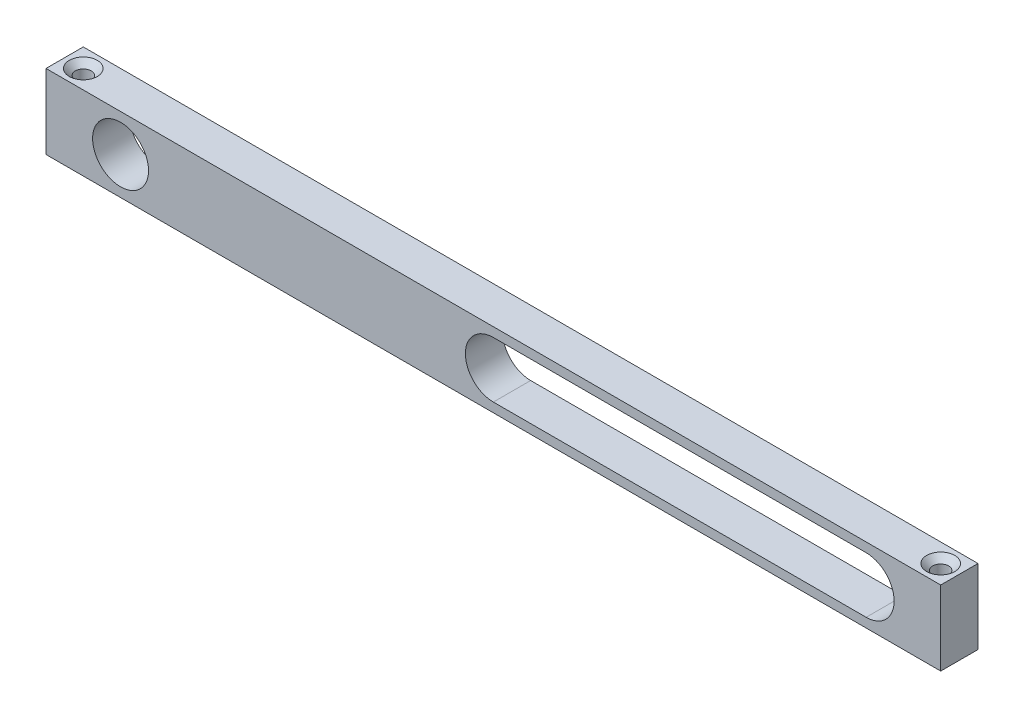
ISO-10303-21;
HEADER;
FILE_DESCRIPTION(('STEP AP214'),'2;1');
FILE_NAME('part.step','',(''),(''),'','','');
FILE_SCHEMA(('AUTOMOTIVE_DESIGN { 1 0 10303 214 1 1 1 1 }'));
ENDSEC;
DATA;
#1=APPLICATION_CONTEXT('core data for automotive mechanical design processes');
#2=APPLICATION_PROTOCOL_DEFINITION('international standard','automotive_design',2000,#1);
#3=PRODUCT_CONTEXT('',#1,'mechanical');
#4=PRODUCT('Part','Part','',(#3));
#5=PRODUCT_RELATED_PRODUCT_CATEGORY('part','',(#4));
#6=PRODUCT_DEFINITION_FORMATION('','',#4);
#7=PRODUCT_DEFINITION_CONTEXT('part definition',#1,'design');
#8=PRODUCT_DEFINITION('design','',#6,#7);
#9=PRODUCT_DEFINITION_SHAPE('','',#8);
#10=(LENGTH_UNIT() NAMED_UNIT(*) SI_UNIT(.MILLI.,.METRE.));
#11=(NAMED_UNIT(*) PLANE_ANGLE_UNIT() SI_UNIT($,.RADIAN.));
#12=(NAMED_UNIT(*) SI_UNIT($,.STERADIAN.) SOLID_ANGLE_UNIT());
#13=UNCERTAINTY_MEASURE_WITH_UNIT(LENGTH_MEASURE(1.E-05),#10,'distance_accuracy_value','');
#14=(GEOMETRIC_REPRESENTATION_CONTEXT(3) GLOBAL_UNCERTAINTY_ASSIGNED_CONTEXT((#13)) GLOBAL_UNIT_ASSIGNED_CONTEXT((#10,
#11,#12)) REPRESENTATION_CONTEXT('',''));
#15=CARTESIAN_POINT('',(0.,0.,0.));
#16=DIRECTION('',(0.,0.,1.));
#17=DIRECTION('',(1.,0.,0.));
#18=AXIS2_PLACEMENT_3D('',#15,#16,#17);
#19=CARTESIAN_POINT('',(0.,0.,6.35));
#20=DIRECTION('',(0.,0.,-1.));
#21=DIRECTION('',(-1.,0.,0.));
#22=AXIS2_PLACEMENT_3D('',#19,#20,#21);
#23=PLANE('',#22);
#24=DIRECTION('',(0.,1.,0.));
#25=VECTOR('',#24,1.);
#26=CARTESIAN_POINT('',(76.2,-6.35,6.35));
#27=LINE('',#26,#25);
#28=CARTESIAN_POINT('',(76.2,-6.35,6.35));
#29=VERTEX_POINT('',#28);
#30=CARTESIAN_POINT('',(76.2,6.35,6.35));
#31=VERTEX_POINT('',#30);
#32=EDGE_CURVE('E147',#29,#31,#27,.T.);
#33=ORIENTED_EDGE('',*,*,#32,.T.);
#34=DIRECTION('',(-1.,0.,0.));
#35=VECTOR('',#34,1.);
#36=CARTESIAN_POINT('',(-76.2,6.35,6.35));
#37=LINE('',#36,#35);
#38=CARTESIAN_POINT('',(-76.2,6.35,6.35));
#39=VERTEX_POINT('',#38);
#40=EDGE_CURVE('E150',#31,#39,#37,.T.);
#41=ORIENTED_EDGE('',*,*,#40,.T.);
#42=DIRECTION('',(0.,-1.,0.));
#43=VECTOR('',#42,1.);
#44=CARTESIAN_POINT('',(-76.2,-6.35,6.35));
#45=LINE('',#44,#43);
#46=CARTESIAN_POINT('',(-76.2,-6.35,6.35));
#47=VERTEX_POINT('',#46);
#48=EDGE_CURVE('E153',#39,#47,#45,.T.);
#49=ORIENTED_EDGE('',*,*,#48,.T.);
#50=DIRECTION('',(1.,0.,0.));
#51=VECTOR('',#50,1.);
#52=CARTESIAN_POINT('',(-76.2,-6.35,6.35));
#53=LINE('',#52,#51);
#54=EDGE_CURVE('E155',#47,#29,#53,.T.);
#55=ORIENTED_EDGE('',*,*,#54,.T.);
#56=EDGE_LOOP('',(#33,#41,#49,#55));
#57=FACE_BOUND('',#56,.T.);
#58=CARTESIAN_POINT('',(0.,0.,6.35));
#59=DIRECTION('',(0.,0.,1.));
#60=DIRECTION('',(1.,0.,0.));
#61=AXIS2_PLACEMENT_3D('',#58,#59,#60);
#62=CIRCLE('',#61,4.7625);
#63=CARTESIAN_POINT('',(0.,4.7625,6.35));
#64=VERTEX_POINT('',#63);
#65=CARTESIAN_POINT('',(0.,-4.7625,6.35));
#66=VERTEX_POINT('',#65);
#67=EDGE_CURVE('E108',#64,#66,#62,.T.);
#68=ORIENTED_EDGE('',*,*,#67,.F.);
#69=DIRECTION('',(-1.,0.,0.));
#70=VECTOR('',#69,1.);
#71=CARTESIAN_POINT('',(0.,4.7625,6.35));
#72=LINE('',#71,#70);
#73=CARTESIAN_POINT('',(63.5,4.7625,6.35));
#74=VERTEX_POINT('',#73);
#75=EDGE_CURVE('E131',#74,#64,#72,.T.);
#76=ORIENTED_EDGE('',*,*,#75,.F.);
#77=CARTESIAN_POINT('',(63.5,0.,6.35));
#78=DIRECTION('',(0.,0.,1.));
#79=DIRECTION('',(1.,0.,0.));
#80=AXIS2_PLACEMENT_3D('',#77,#78,#79);
#81=CIRCLE('',#80,4.7625);
#82=CARTESIAN_POINT('',(63.5,-4.7625,6.35));
#83=VERTEX_POINT('',#82);
#84=EDGE_CURVE('E129',#83,#74,#81,.T.);
#85=ORIENTED_EDGE('',*,*,#84,.F.);
#86=DIRECTION('',(1.,0.,0.));
#87=VECTOR('',#86,1.);
#88=CARTESIAN_POINT('',(0.,-4.7625,6.35));
#89=LINE('',#88,#87);
#90=EDGE_CURVE('E116',#66,#83,#89,.T.);
#91=ORIENTED_EDGE('',*,*,#90,.F.);
#92=EDGE_LOOP('',(#68,#76,#85,#91));
#93=FACE_BOUND('',#92,.T.);
#94=CARTESIAN_POINT('',(-63.5,0.,6.35));
#95=DIRECTION('',(0.,0.,1.));
#96=DIRECTION('',(1.,0.,0.));
#97=AXIS2_PLACEMENT_3D('',#94,#95,#96);
#98=CIRCLE('',#97,4.7625);
#99=CARTESIAN_POINT('',(-58.7375,0.,6.35));
#100=VERTEX_POINT('',#99);
#101=EDGE_CURVE('E137',#100,#100,#98,.T.);
#102=ORIENTED_EDGE('',*,*,#101,.F.);
#103=EDGE_LOOP('',(#102));
#104=FACE_BOUND('',#103,.T.);
#105=ADVANCED_FACE('F43',(#57,#93,#104),#23,.F.);
#106=CARTESIAN_POINT('',(0.,0.,0.));
#107=DIRECTION('',(0.,0.,-1.));
#108=DIRECTION('',(-1.,0.,0.));
#109=AXIS2_PLACEMENT_3D('',#106,#107,#108);
#110=PLANE('',#109);
#111=DIRECTION('',(-1.,0.,0.));
#112=VECTOR('',#111,1.);
#113=CARTESIAN_POINT('',(0.,4.7625,0.));
#114=LINE('',#113,#112);
#115=CARTESIAN_POINT('',(63.5,4.7625,0.));
#116=VERTEX_POINT('',#115);
#117=CARTESIAN_POINT('',(0.,4.7625,0.));
#118=VERTEX_POINT('',#117);
#119=EDGE_CURVE('E117',#116,#118,#114,.T.);
#120=ORIENTED_EDGE('',*,*,#119,.T.);
#121=CARTESIAN_POINT('',(0.,0.,0.));
#122=DIRECTION('',(0.,0.,1.));
#123=DIRECTION('',(1.,0.,0.));
#124=AXIS2_PLACEMENT_3D('',#121,#122,#123);
#125=CIRCLE('',#124,4.7625);
#126=CARTESIAN_POINT('',(0.,-4.7625,0.));
#127=VERTEX_POINT('',#126);
#128=EDGE_CURVE('E66',#118,#127,#125,.T.);
#129=ORIENTED_EDGE('',*,*,#128,.T.);
#130=DIRECTION('',(1.,0.,0.));
#131=VECTOR('',#130,1.);
#132=CARTESIAN_POINT('',(0.,-4.7625,0.));
#133=LINE('',#132,#131);
#134=CARTESIAN_POINT('',(63.5,-4.7625,0.));
#135=VERTEX_POINT('',#134);
#136=EDGE_CURVE('E123',#127,#135,#133,.T.);
#137=ORIENTED_EDGE('',*,*,#136,.T.);
#138=CARTESIAN_POINT('',(63.5,0.,0.));
#139=DIRECTION('',(0.,0.,1.));
#140=DIRECTION('',(1.,0.,0.));
#141=AXIS2_PLACEMENT_3D('',#138,#139,#140);
#142=CIRCLE('',#141,4.7625);
#143=EDGE_CURVE('E139',#135,#116,#142,.T.);
#144=ORIENTED_EDGE('',*,*,#143,.T.);
#145=EDGE_LOOP('',(#120,#129,#137,#144));
#146=FACE_BOUND('',#145,.T.);
#147=DIRECTION('',(0.,1.,0.));
#148=VECTOR('',#147,1.);
#149=CARTESIAN_POINT('',(76.2,-6.35,0.));
#150=LINE('',#149,#148);
#151=CARTESIAN_POINT('',(76.2,-6.35,0.));
#152=VERTEX_POINT('',#151);
#153=CARTESIAN_POINT('',(76.2,6.35,0.));
#154=VERTEX_POINT('',#153);
#155=EDGE_CURVE('E124',#152,#154,#150,.T.);
#156=ORIENTED_EDGE('',*,*,#155,.F.);
#157=DIRECTION('',(1.,0.,0.));
#158=VECTOR('',#157,1.);
#159=CARTESIAN_POINT('',(-76.2,-6.35,0.));
#160=LINE('',#159,#158);
#161=CARTESIAN_POINT('',(-76.2,-6.35,0.));
#162=VERTEX_POINT('',#161);
#163=EDGE_CURVE('E151',#162,#152,#160,.T.);
#164=ORIENTED_EDGE('',*,*,#163,.F.);
#165=DIRECTION('',(0.,-1.,0.));
#166=VECTOR('',#165,1.);
#167=CARTESIAN_POINT('',(-76.2,-6.35,0.));
#168=LINE('',#167,#166);
#169=CARTESIAN_POINT('',(-76.2,6.35,0.));
#170=VERTEX_POINT('',#169);
#171=EDGE_CURVE('E162',#170,#162,#168,.T.);
#172=ORIENTED_EDGE('',*,*,#171,.F.);
#173=DIRECTION('',(-1.,0.,0.));
#174=VECTOR('',#173,1.);
#175=CARTESIAN_POINT('',(-76.2,6.35,0.));
#176=LINE('',#175,#174);
#177=EDGE_CURVE('E160',#154,#170,#176,.T.);
#178=ORIENTED_EDGE('',*,*,#177,.F.);
#179=EDGE_LOOP('',(#156,#164,#172,#178));
#180=FACE_BOUND('',#179,.T.);
#181=CARTESIAN_POINT('',(-63.5,0.,0.));
#182=DIRECTION('',(0.,0.,1.));
#183=DIRECTION('',(1.,0.,0.));
#184=AXIS2_PLACEMENT_3D('',#181,#182,#183);
#185=CIRCLE('',#184,4.7625);
#186=CARTESIAN_POINT('',(-58.7375,0.,0.));
#187=VERTEX_POINT('',#186);
#188=EDGE_CURVE('E225',#187,#187,#185,.T.);
#189=ORIENTED_EDGE('',*,*,#188,.T.);
#190=EDGE_LOOP('',(#189));
#191=FACE_BOUND('',#190,.T.);
#192=ADVANCED_FACE('F180',(#146,#180,#191),#110,.T.);
#193=CARTESIAN_POINT('',(76.2,-6.35,6.35));
#194=DIRECTION('',(-1.,0.,0.));
#195=DIRECTION('',(0.,0.,1.));
#196=AXIS2_PLACEMENT_3D('',#193,#194,#195);
#197=PLANE('',#196);
#198=ORIENTED_EDGE('',*,*,#155,.T.);
#199=DIRECTION('',(0.,0.,-1.));
#200=VECTOR('',#199,1.);
#201=CARTESIAN_POINT('',(76.2,6.35,6.35));
#202=LINE('',#201,#200);
#203=EDGE_CURVE('E11',#31,#154,#202,.T.);
#204=ORIENTED_EDGE('',*,*,#203,.F.);
#205=ORIENTED_EDGE('',*,*,#32,.F.);
#206=DIRECTION('',(0.,0.,-1.));
#207=VECTOR('',#206,1.);
#208=CARTESIAN_POINT('',(76.2,-6.35,6.35));
#209=LINE('',#208,#207);
#210=EDGE_CURVE('E157',#29,#152,#209,.T.);
#211=ORIENTED_EDGE('',*,*,#210,.T.);
#212=EDGE_LOOP('',(#198,#204,#205,#211));
#213=FACE_BOUND('',#212,.T.);
#214=ADVANCED_FACE('F45',(#213),#197,.F.);
#215=CARTESIAN_POINT('',(-76.2,6.35,6.35));
#216=DIRECTION('',(0.,-1.,0.));
#217=DIRECTION('',(0.,0.,-1.));
#218=AXIS2_PLACEMENT_3D('',#215,#216,#217);
#219=PLANE('',#218);
#220=CARTESIAN_POINT('',(73.025,6.35,3.175));
#221=DIRECTION('',(0.,1.,0.));
#222=DIRECTION('',(0.,0.,1.));
#223=AXIS2_PLACEMENT_3D('',#220,#221,#222);
#224=CIRCLE('',#223,2.3876);
#225=CARTESIAN_POINT('',(73.025,6.35,5.5626));
#226=VERTEX_POINT('',#225);
#227=EDGE_CURVE('E330',#226,#226,#224,.T.);
#228=ORIENTED_EDGE('',*,*,#227,.F.);
#229=EDGE_LOOP('',(#228));
#230=FACE_BOUND('',#229,.T.);
#231=CARTESIAN_POINT('',(-73.025,6.35,3.175));
#232=DIRECTION('',(0.,1.,0.));
#233=DIRECTION('',(0.,0.,1.));
#234=AXIS2_PLACEMENT_3D('',#231,#232,#233);
#235=CIRCLE('',#234,2.3876);
#236=CARTESIAN_POINT('',(-73.025,6.35,5.5626));
#237=VERTEX_POINT('',#236);
#238=EDGE_CURVE('E230',#237,#237,#235,.T.);
#239=ORIENTED_EDGE('',*,*,#238,.F.);
#240=EDGE_LOOP('',(#239));
#241=FACE_BOUND('',#240,.T.);
#242=ORIENTED_EDGE('',*,*,#177,.T.);
#243=DIRECTION('',(0.,0.,-1.));
#244=VECTOR('',#243,1.);
#245=CARTESIAN_POINT('',(-76.2,6.35,6.35));
#246=LINE('',#245,#244);
#247=EDGE_CURVE('E51',#39,#170,#246,.T.);
#248=ORIENTED_EDGE('',*,*,#247,.F.);
#249=ORIENTED_EDGE('',*,*,#40,.F.);
#250=ORIENTED_EDGE('',*,*,#203,.T.);
#251=EDGE_LOOP('',(#242,#248,#249,#250));
#252=FACE_BOUND('',#251,.T.);
#253=ADVANCED_FACE('F190',(#230,#241,#252),#219,.F.);
#254=CARTESIAN_POINT('',(-76.2,-6.35,6.35));
#255=DIRECTION('',(1.,0.,0.));
#256=DIRECTION('',(0.,0.,-1.));
#257=AXIS2_PLACEMENT_3D('',#254,#255,#256);
#258=PLANE('',#257);
#259=ORIENTED_EDGE('',*,*,#171,.T.);
#260=DIRECTION('',(0.,0.,-1.));
#261=VECTOR('',#260,1.);
#262=CARTESIAN_POINT('',(-76.2,-6.35,6.35));
#263=LINE('',#262,#261);
#264=EDGE_CURVE('E167',#47,#162,#263,.T.);
#265=ORIENTED_EDGE('',*,*,#264,.F.);
#266=ORIENTED_EDGE('',*,*,#48,.F.);
#267=ORIENTED_EDGE('',*,*,#247,.T.);
#268=EDGE_LOOP('',(#259,#265,#266,#267));
#269=FACE_BOUND('',#268,.T.);
#270=ADVANCED_FACE('F174',(#269),#258,.F.);
#271=CARTESIAN_POINT('',(-76.2,-6.35,6.35));
#272=DIRECTION('',(0.,1.,0.));
#273=DIRECTION('',(0.,0.,1.));
#274=AXIS2_PLACEMENT_3D('',#271,#272,#273);
#275=PLANE('',#274);
#276=CARTESIAN_POINT('',(73.025,-6.35,3.175));
#277=DIRECTION('',(0.,1.,0.));
#278=DIRECTION('',(0.,0.,1.));
#279=AXIS2_PLACEMENT_3D('',#276,#277,#278);
#280=CIRCLE('',#279,1.35254999999999);
#281=CARTESIAN_POINT('',(73.025,-6.35,4.52754999999999));
#282=VERTEX_POINT('',#281);
#283=EDGE_CURVE('E220',#282,#282,#280,.T.);
#284=ORIENTED_EDGE('',*,*,#283,.T.);
#285=EDGE_LOOP('',(#284));
#286=FACE_BOUND('',#285,.T.);
#287=CARTESIAN_POINT('',(-73.025,-6.35,3.175));
#288=DIRECTION('',(0.,1.,0.));
#289=DIRECTION('',(0.,0.,1.));
#290=AXIS2_PLACEMENT_3D('',#287,#288,#289);
#291=CIRCLE('',#290,1.35254999999999);
#292=CARTESIAN_POINT('',(-73.025,-6.35,4.52754999999999));
#293=VERTEX_POINT('',#292);
#294=EDGE_CURVE('E223',#293,#293,#291,.T.);
#295=ORIENTED_EDGE('',*,*,#294,.T.);
#296=EDGE_LOOP('',(#295));
#297=FACE_BOUND('',#296,.T.);
#298=ORIENTED_EDGE('',*,*,#163,.T.);
#299=ORIENTED_EDGE('',*,*,#210,.F.);
#300=ORIENTED_EDGE('',*,*,#54,.F.);
#301=ORIENTED_EDGE('',*,*,#264,.T.);
#302=EDGE_LOOP('',(#298,#299,#300,#301));
#303=FACE_BOUND('',#302,.T.);
#304=ADVANCED_FACE('F184',(#286,#297,#303),#275,.F.);
#305=CARTESIAN_POINT('',(0.,0.,6.35));
#306=DIRECTION('',(0.,0.,-1.));
#307=DIRECTION('',(-1.,0.,0.));
#308=AXIS2_PLACEMENT_3D('',#305,#306,#307);
#309=CYLINDRICAL_SURFACE('',#308,4.7625);
#310=ORIENTED_EDGE('',*,*,#128,.F.);
#311=DIRECTION('',(0.,0.,-1.));
#312=VECTOR('',#311,1.);
#313=CARTESIAN_POINT('',(0.,4.7625,6.35));
#314=LINE('',#313,#312);
#315=EDGE_CURVE('E112',#64,#118,#314,.T.);
#316=ORIENTED_EDGE('',*,*,#315,.F.);
#317=ORIENTED_EDGE('',*,*,#67,.T.);
#318=DIRECTION('',(0.,0.,-1.));
#319=VECTOR('',#318,1.);
#320=CARTESIAN_POINT('',(0.,-4.7625,6.35));
#321=LINE('',#320,#319);
#322=EDGE_CURVE('E111',#66,#127,#321,.T.);
#323=ORIENTED_EDGE('',*,*,#322,.T.);
#324=EDGE_LOOP('',(#310,#316,#317,#323));
#325=FACE_BOUND('',#324,.T.);
#326=ADVANCED_FACE('F110',(#325),#309,.F.);
#327=CARTESIAN_POINT('',(0.,-4.7625,6.35));
#328=DIRECTION('',(0.,1.,0.));
#329=DIRECTION('',(0.,0.,1.));
#330=AXIS2_PLACEMENT_3D('',#327,#328,#329);
#331=PLANE('',#330);
#332=ORIENTED_EDGE('',*,*,#136,.F.);
#333=ORIENTED_EDGE('',*,*,#322,.F.);
#334=ORIENTED_EDGE('',*,*,#90,.T.);
#335=DIRECTION('',(0.,0.,-1.));
#336=VECTOR('',#335,1.);
#337=CARTESIAN_POINT('',(63.5,-4.7625,6.35));
#338=LINE('',#337,#336);
#339=EDGE_CURVE('E125',#83,#135,#338,.T.);
#340=ORIENTED_EDGE('',*,*,#339,.T.);
#341=EDGE_LOOP('',(#332,#333,#334,#340));
#342=FACE_BOUND('',#341,.T.);
#343=ADVANCED_FACE('F120',(#342),#331,.T.);
#344=CARTESIAN_POINT('',(63.5,0.,6.35));
#345=DIRECTION('',(0.,0.,-1.));
#346=DIRECTION('',(-1.,0.,0.));
#347=AXIS2_PLACEMENT_3D('',#344,#345,#346);
#348=CYLINDRICAL_SURFACE('',#347,4.7625);
#349=ORIENTED_EDGE('',*,*,#143,.F.);
#350=ORIENTED_EDGE('',*,*,#339,.F.);
#351=ORIENTED_EDGE('',*,*,#84,.T.);
#352=DIRECTION('',(0.,0.,-1.));
#353=VECTOR('',#352,1.);
#354=CARTESIAN_POINT('',(63.5,4.7625,6.35));
#355=LINE('',#354,#353);
#356=EDGE_CURVE('E58',#74,#116,#355,.T.);
#357=ORIENTED_EDGE('',*,*,#356,.T.);
#358=EDGE_LOOP('',(#349,#350,#351,#357));
#359=FACE_BOUND('',#358,.T.);
#360=ADVANCED_FACE('F251',(#359),#348,.F.);
#361=CARTESIAN_POINT('',(0.,4.7625,6.35));
#362=DIRECTION('',(0.,-1.,0.));
#363=DIRECTION('',(0.,0.,-1.));
#364=AXIS2_PLACEMENT_3D('',#361,#362,#363);
#365=PLANE('',#364);
#366=ORIENTED_EDGE('',*,*,#119,.F.);
#367=ORIENTED_EDGE('',*,*,#356,.F.);
#368=ORIENTED_EDGE('',*,*,#75,.T.);
#369=ORIENTED_EDGE('',*,*,#315,.T.);
#370=EDGE_LOOP('',(#366,#367,#368,#369));
#371=FACE_BOUND('',#370,.T.);
#372=ADVANCED_FACE('F241',(#371),#365,.T.);
#373=CARTESIAN_POINT('',(-63.5,0.,6.35));
#374=DIRECTION('',(0.,0.,-1.));
#375=DIRECTION('',(-1.,0.,0.));
#376=AXIS2_PLACEMENT_3D('',#373,#374,#375);
#377=CYLINDRICAL_SURFACE('',#376,4.7625);
#378=ORIENTED_EDGE('',*,*,#101,.T.);
#379=EDGE_LOOP('',(#378));
#380=FACE_BOUND('',#379,.T.);
#381=ORIENTED_EDGE('',*,*,#188,.F.);
#382=EDGE_LOOP('',(#381));
#383=FACE_BOUND('',#382,.T.);
#384=ADVANCED_FACE('F237',(#380,#383),#377,.F.);
#385=CARTESIAN_POINT('',(-73.025,6.35,3.175));
#386=DIRECTION('',(0.,1.,0.));
#387=DIRECTION('',(0.,0.,1.));
#388=AXIS2_PLACEMENT_3D('',#385,#386,#387);
#389=CYLINDRICAL_SURFACE('',#388,1.35254999999999);
#390=ORIENTED_EDGE('',*,*,#294,.F.);
#391=EDGE_LOOP('',(#390));
#392=FACE_BOUND('',#391,.T.);
#393=CARTESIAN_POINT('',(-73.025,5.31495,3.175));
#394=DIRECTION('',(0.,1.,0.));
#395=DIRECTION('',(0.,0.,1.));
#396=AXIS2_PLACEMENT_3D('',#393,#394,#395);
#397=CIRCLE('',#396,1.35254999999999);
#398=CARTESIAN_POINT('',(-73.025,5.31495,4.52754999999999));
#399=VERTEX_POINT('',#398);
#400=EDGE_CURVE('E226',#399,#399,#397,.T.);
#401=ORIENTED_EDGE('',*,*,#400,.T.);
#402=EDGE_LOOP('',(#401));
#403=FACE_BOUND('',#402,.T.);
#404=ADVANCED_FACE('F240',(#392,#403),#389,.F.);
#405=CARTESIAN_POINT('',(-73.025,6.35,3.175));
#406=DIRECTION('',(0.,1.,0.));
#407=DIRECTION('',(0.,0.,1.));
#408=AXIS2_PLACEMENT_3D('',#405,#406,#407);
#409=CONICAL_SURFACE('',#408,2.3876,0.785398163397452);
#410=ORIENTED_EDGE('',*,*,#400,.F.);
#411=EDGE_LOOP('',(#410));
#412=FACE_BOUND('',#411,.T.);
#413=ORIENTED_EDGE('',*,*,#238,.T.);
#414=EDGE_LOOP('',(#413));
#415=FACE_BOUND('',#414,.T.);
#416=ADVANCED_FACE('F249',(#412,#415),#409,.F.);
#417=CARTESIAN_POINT('',(73.025,6.35,3.175));
#418=DIRECTION('',(0.,1.,0.));
#419=DIRECTION('',(0.,0.,1.));
#420=AXIS2_PLACEMENT_3D('',#417,#418,#419);
#421=CYLINDRICAL_SURFACE('',#420,1.35254999999999);
#422=ORIENTED_EDGE('',*,*,#283,.F.);
#423=EDGE_LOOP('',(#422));
#424=FACE_BOUND('',#423,.T.);
#425=CARTESIAN_POINT('',(73.025,5.31495,3.175));
#426=DIRECTION('',(0.,1.,0.));
#427=DIRECTION('',(0.,0.,1.));
#428=AXIS2_PLACEMENT_3D('',#425,#426,#427);
#429=CIRCLE('',#428,1.35254999999998);
#430=CARTESIAN_POINT('',(73.025,5.31495,4.52754999999998));
#431=VERTEX_POINT('',#430);
#432=EDGE_CURVE('E328',#431,#431,#429,.T.);
#433=ORIENTED_EDGE('',*,*,#432,.T.);
#434=EDGE_LOOP('',(#433));
#435=FACE_BOUND('',#434,.T.);
#436=ADVANCED_FACE('F293',(#424,#435),#421,.F.);
#437=CARTESIAN_POINT('',(73.025,6.35,3.175));
#438=DIRECTION('',(0.,1.,0.));
#439=DIRECTION('',(0.,0.,1.));
#440=AXIS2_PLACEMENT_3D('',#437,#438,#439);
#441=CONICAL_SURFACE('',#440,2.3876,0.785398163397461);
#442=ORIENTED_EDGE('',*,*,#432,.F.);
#443=EDGE_LOOP('',(#442));
#444=FACE_BOUND('',#443,.T.);
#445=ORIENTED_EDGE('',*,*,#227,.T.);
#446=EDGE_LOOP('',(#445));
#447=FACE_BOUND('',#446,.T.);
#448=ADVANCED_FACE('F302',(#444,#447),#441,.F.);
#449=CLOSED_SHELL('',(#105,#192,#214,#253,#270,#304,#326,#343,#360,#372,#384,#404,#416,#436,#448));
#450=MANIFOLD_SOLID_BREP('B2',#449);
#451=ADVANCED_BREP_SHAPE_REPRESENTATION('',(#18,#450),#14);
#452=SHAPE_DEFINITION_REPRESENTATION(#9,#451);
ENDSEC;
END-ISO-10303-21;
